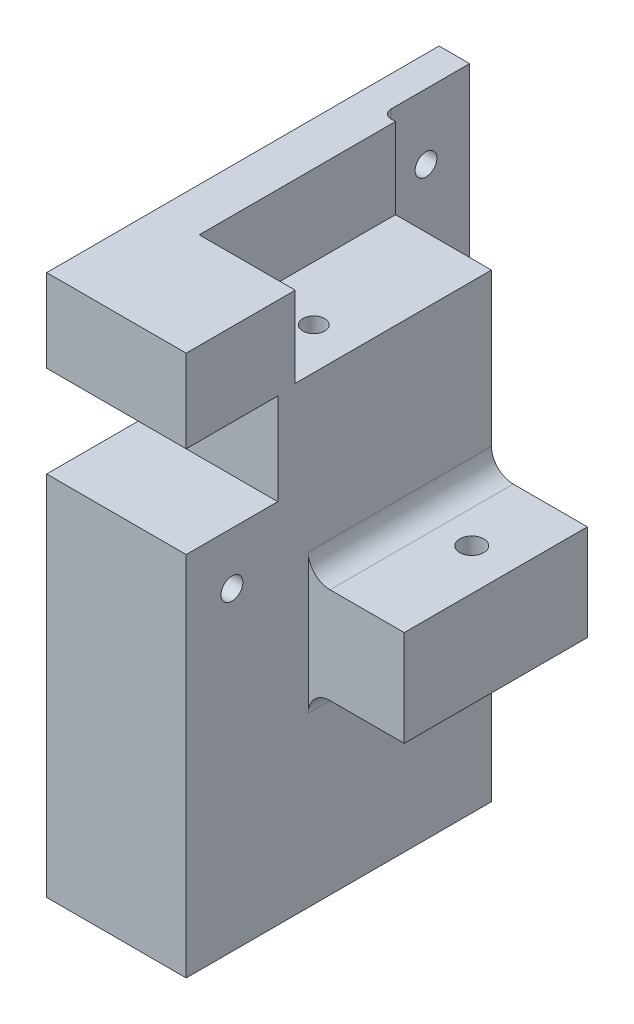
ISO-10303-21;
HEADER;
FILE_DESCRIPTION(('STEP AP214'),'2;1');
FILE_NAME('part.step','',(''),(''),'','','');
FILE_SCHEMA(('AUTOMOTIVE_DESIGN { 1 0 10303 214 1 1 1 1 }'));
ENDSEC;
DATA;
#1=APPLICATION_CONTEXT('core data for automotive mechanical design processes');
#2=APPLICATION_PROTOCOL_DEFINITION('international standard','automotive_design',2000,#1);
#3=PRODUCT_CONTEXT('',#1,'mechanical');
#4=PRODUCT('Part','Part','',(#3));
#5=PRODUCT_RELATED_PRODUCT_CATEGORY('part','',(#4));
#6=PRODUCT_DEFINITION_FORMATION('','',#4);
#7=PRODUCT_DEFINITION_CONTEXT('part definition',#1,'design');
#8=PRODUCT_DEFINITION('design','',#6,#7);
#9=PRODUCT_DEFINITION_SHAPE('','',#8);
#10=(LENGTH_UNIT() NAMED_UNIT(*) SI_UNIT(.MILLI.,.METRE.));
#11=(NAMED_UNIT(*) PLANE_ANGLE_UNIT() SI_UNIT($,.RADIAN.));
#12=(NAMED_UNIT(*) SI_UNIT($,.STERADIAN.) SOLID_ANGLE_UNIT());
#13=UNCERTAINTY_MEASURE_WITH_UNIT(LENGTH_MEASURE(1.E-05),#10,'distance_accuracy_value','');
#14=(GEOMETRIC_REPRESENTATION_CONTEXT(3) GLOBAL_UNCERTAINTY_ASSIGNED_CONTEXT((#13)) GLOBAL_UNIT_ASSIGNED_CONTEXT((#10,
#11,#12)) REPRESENTATION_CONTEXT('',''));
#15=CARTESIAN_POINT('',(0.,0.,0.));
#16=DIRECTION('',(0.,0.,1.));
#17=DIRECTION('',(1.,0.,0.));
#18=AXIS2_PLACEMENT_3D('',#15,#16,#17);
#19=CARTESIAN_POINT('',(16.,40.,-35.));
#20=DIRECTION('',(-1.,0.,0.));
#21=DIRECTION('',(0.,0.,1.));
#22=AXIS2_PLACEMENT_3D('',#19,#20,#21);
#23=PLANE('',#22);
#24=CARTESIAN_POINT('',(16.,-12.,24.5));
#25=DIRECTION('',(-1.,0.,0.));
#26=DIRECTION('',(0.,0.,1.));
#27=AXIS2_PLACEMENT_3D('',#24,#25,#26);
#28=CIRCLE('',#27,2.5);
#29=CARTESIAN_POINT('',(16.,-12.,27.));
#30=VERTEX_POINT('',#29);
#31=EDGE_CURVE('E209',#30,#30,#28,.T.);
#32=ORIENTED_EDGE('',*,*,#31,.T.);
#33=EDGE_LOOP('',(#32));
#34=FACE_BOUND('',#33,.T.);
#35=DIRECTION('',(0.,-1.,0.));
#36=VECTOR('',#35,1.);
#37=CARTESIAN_POINT('',(16.,-18.5000000000002,6.99999999999999));
#38=LINE('',#37,#36);
#39=CARTESIAN_POINT('',(16.,-13.5000000000002,6.99999999999999));
#40=VERTEX_POINT('',#39);
#41=CARTESIAN_POINT('',(16.,-45.5000000000002,7.));
#42=VERTEX_POINT('',#41);
#43=EDGE_CURVE('E227',#40,#42,#38,.T.);
#44=ORIENTED_EDGE('',*,*,#43,.F.);
#45=DIRECTION('',(0.,0.,1.));
#46=VECTOR('',#45,1.);
#47=CARTESIAN_POINT('',(16.,-13.5000000000002,-35.));
#48=LINE('',#47,#46);
#49=CARTESIAN_POINT('',(16.,-13.5000000000002,-35.));
#50=VERTEX_POINT('',#49);
#51=EDGE_CURVE('E345',#40,#50,#48,.F.);
#52=ORIENTED_EDGE('',*,*,#51,.T.);
#53=DIRECTION('',(0.,-1.,0.));
#54=VECTOR('',#53,1.);
#55=CARTESIAN_POINT('',(16.,40.,-35.));
#56=LINE('',#55,#54);
#57=CARTESIAN_POINT('',(16.,21.4999999999998,-35.));
#58=VERTEX_POINT('',#57);
#59=EDGE_CURVE('E330',#58,#50,#56,.T.);
#60=ORIENTED_EDGE('',*,*,#59,.F.);
#61=DIRECTION('',(0.,0.,-1.));
#62=VECTOR('',#61,1.);
#63=CARTESIAN_POINT('',(16.,21.4999999999998,-35.));
#64=LINE('',#63,#62);
#65=CARTESIAN_POINT('',(16.,21.4999999999998,9.99999999999999));
#66=VERTEX_POINT('',#65);
#67=EDGE_CURVE('E267',#66,#58,#64,.T.);
#68=ORIENTED_EDGE('',*,*,#67,.F.);
#69=DIRECTION('',(0.,1.,0.));
#70=VECTOR('',#69,1.);
#71=CARTESIAN_POINT('',(16.,-28.589919145473,9.99999999999999));
#72=LINE('',#71,#70);
#73=CARTESIAN_POINT('',(16.,40.,9.99999999999999));
#74=VERTEX_POINT('',#73);
#75=EDGE_CURVE('E258',#66,#74,#72,.T.);
#76=ORIENTED_EDGE('',*,*,#75,.T.);
#77=DIRECTION('',(0.,0.,-1.));
#78=VECTOR('',#77,1.);
#79=CARTESIAN_POINT('',(16.,40.,-35.));
#80=LINE('',#79,#78);
#81=CARTESIAN_POINT('',(16.,40.,35.));
#82=VERTEX_POINT('',#81);
#83=EDGE_CURVE('E310',#82,#74,#80,.T.);
#84=ORIENTED_EDGE('',*,*,#83,.F.);
#85=DIRECTION('',(0.,-1.,0.));
#86=VECTOR('',#85,1.);
#87=CARTESIAN_POINT('',(16.,40.,35.));
#88=LINE('',#87,#86);
#89=CARTESIAN_POINT('',(16.,21.,35.));
#90=VERTEX_POINT('',#89);
#91=EDGE_CURVE('E320',#82,#90,#88,.T.);
#92=ORIENTED_EDGE('',*,*,#91,.T.);
#93=DIRECTION('',(0.,0.,1.));
#94=VECTOR('',#93,1.);
#95=CARTESIAN_POINT('',(16.,21.,35.));
#96=LINE('',#95,#94);
#97=CARTESIAN_POINT('',(16.,21.,14.));
#98=VERTEX_POINT('',#97);
#99=EDGE_CURVE('E279',#98,#90,#96,.T.);
#100=ORIENTED_EDGE('',*,*,#99,.F.);
#101=DIRECTION('',(0.,1.,0.));
#102=VECTOR('',#101,1.);
#103=CARTESIAN_POINT('',(16.,21.,14.));
#104=LINE('',#103,#102);
#105=CARTESIAN_POINT('',(16.,0.,14.));
#106=VERTEX_POINT('',#105);
#107=EDGE_CURVE('E276',#106,#98,#104,.T.);
#108=ORIENTED_EDGE('',*,*,#107,.F.);
#109=DIRECTION('',(0.,0.,-1.));
#110=VECTOR('',#109,1.);
#111=CARTESIAN_POINT('',(16.,0.,35.));
#112=LINE('',#111,#110);
#113=CARTESIAN_POINT('',(16.,0.,35.));
#114=VERTEX_POINT('',#113);
#115=EDGE_CURVE('E273',#114,#106,#112,.T.);
#116=ORIENTED_EDGE('',*,*,#115,.F.);
#117=CARTESIAN_POINT('',(16.,-84.1,35.));
#118=VERTEX_POINT('',#117);
#119=EDGE_CURVE('E319',#114,#118,#88,.T.);
#120=ORIENTED_EDGE('',*,*,#119,.T.);
#121=DIRECTION('',(0.,0.,-1.));
#122=VECTOR('',#121,1.);
#123=CARTESIAN_POINT('',(16.,-84.1,-35.));
#124=LINE('',#123,#122);
#125=CARTESIAN_POINT('',(16.,-84.1,-35.));
#126=VERTEX_POINT('',#125);
#127=EDGE_CURVE('E293',#118,#126,#124,.T.);
#128=ORIENTED_EDGE('',*,*,#127,.T.);
#129=CARTESIAN_POINT('',(16.,-45.5000000000002,-35.));
#130=VERTEX_POINT('',#129);
#131=EDGE_CURVE('E329',#130,#126,#56,.T.);
#132=ORIENTED_EDGE('',*,*,#131,.F.);
#133=DIRECTION('',(0.,0.,-1.));
#134=VECTOR('',#133,1.);
#135=CARTESIAN_POINT('',(16.,-45.5000000000002,7.));
#136=LINE('',#135,#134);
#137=EDGE_CURVE('E342',#130,#42,#136,.F.);
#138=ORIENTED_EDGE('',*,*,#137,.T.);
#139=EDGE_LOOP('',(#44,#52,#60,#68,#76,#84,#92,#100,#108,#116,#120,#128,#132,#138));
#140=FACE_BOUND('',#139,.T.);
#141=ADVANCED_FACE('F35',(#34,#140),#23,.F.);
#142=CARTESIAN_POINT('',(-16.,40.,35.));
#143=DIRECTION('',(0.,0.,-1.));
#144=DIRECTION('',(-1.,0.,0.));
#145=AXIS2_PLACEMENT_3D('',#142,#143,#144);
#146=PLANE('',#145);
#147=DIRECTION('',(0.,-1.,0.));
#148=VECTOR('',#147,1.);
#149=CARTESIAN_POINT('',(-16.,40.,35.));
#150=LINE('',#149,#148);
#151=CARTESIAN_POINT('',(-16.,40.,35.));
#152=VERTEX_POINT('',#151);
#153=CARTESIAN_POINT('',(-16.,21.,35.));
#154=VERTEX_POINT('',#153);
#155=EDGE_CURVE('E324',#152,#154,#150,.T.);
#156=ORIENTED_EDGE('',*,*,#155,.T.);
#157=DIRECTION('',(1.,0.,0.));
#158=VECTOR('',#157,1.);
#159=CARTESIAN_POINT('',(-16.,21.,35.));
#160=LINE('',#159,#158);
#161=EDGE_CURVE('E290',#154,#90,#160,.T.);
#162=ORIENTED_EDGE('',*,*,#161,.T.);
#163=ORIENTED_EDGE('',*,*,#91,.F.);
#164=DIRECTION('',(1.,0.,0.));
#165=VECTOR('',#164,1.);
#166=CARTESIAN_POINT('',(-16.,40.,35.));
#167=LINE('',#166,#165);
#168=EDGE_CURVE('E317',#152,#82,#167,.T.);
#169=ORIENTED_EDGE('',*,*,#168,.F.);
#170=EDGE_LOOP('',(#156,#162,#163,#169));
#171=FACE_BOUND('',#170,.T.);
#172=ADVANCED_FACE('F390',(#171),#146,.F.);
#173=CARTESIAN_POINT('',(-16.,40.,-35.));
#174=DIRECTION('',(0.,0.,1.));
#175=DIRECTION('',(1.,0.,0.));
#176=AXIS2_PLACEMENT_3D('',#173,#174,#175);
#177=PLANE('',#176);
#178=DIRECTION('',(0.,-1.,0.));
#179=VECTOR('',#178,1.);
#180=CARTESIAN_POINT('',(-16.,40.,-35.));
#181=LINE('',#180,#179);
#182=CARTESIAN_POINT('',(-16.,-30.,-35.));
#183=VERTEX_POINT('',#182);
#184=CARTESIAN_POINT('',(-16.,-84.1,-35.));
#185=VERTEX_POINT('',#184);
#186=EDGE_CURVE('E327',#183,#185,#181,.T.);
#187=ORIENTED_EDGE('',*,*,#186,.F.);
#188=DIRECTION('',(1.,0.,0.));
#189=VECTOR('',#188,1.);
#190=CARTESIAN_POINT('',(-16.,-30.,-35.));
#191=LINE('',#190,#189);
#192=CARTESIAN_POINT('',(-6.99999999999999,-30.,-35.));
#193=VERTEX_POINT('',#192);
#194=EDGE_CURVE('E350',#183,#193,#191,.T.);
#195=ORIENTED_EDGE('',*,*,#194,.T.);
#196=DIRECTION('',(0.,1.,0.));
#197=VECTOR('',#196,1.);
#198=CARTESIAN_POINT('',(-7.,40.,-35.));
#199=LINE('',#198,#197);
#200=CARTESIAN_POINT('',(-7.,40.,-35.));
#201=VERTEX_POINT('',#200);
#202=EDGE_CURVE('E333',#193,#201,#199,.T.);
#203=ORIENTED_EDGE('',*,*,#202,.T.);
#204=DIRECTION('',(-1.,0.,0.));
#205=VECTOR('',#204,1.);
#206=CARTESIAN_POINT('',(-16.,40.,-35.));
#207=LINE('',#206,#205);
#208=CARTESIAN_POINT('',(-5.99999999999999,40.,-35.));
#209=VERTEX_POINT('',#208);
#210=EDGE_CURVE('E313',#209,#201,#207,.T.);
#211=ORIENTED_EDGE('',*,*,#210,.F.);
#212=DIRECTION('',(0.,1.,0.));
#213=VECTOR('',#212,1.);
#214=CARTESIAN_POINT('',(-5.99999999999999,-28.589919145473,-35.));
#215=LINE('',#214,#213);
#216=CARTESIAN_POINT('',(-5.99999999999999,21.4999999999997,-35.));
#217=VERTEX_POINT('',#216);
#218=EDGE_CURVE('E263',#217,#209,#215,.T.);
#219=ORIENTED_EDGE('',*,*,#218,.F.);
#220=DIRECTION('',(-1.,0.,0.));
#221=VECTOR('',#220,1.);
#222=CARTESIAN_POINT('',(-6.00000000000017,21.4999999999997,-35.));
#223=LINE('',#222,#221);
#224=EDGE_CURVE('E264',#58,#217,#223,.T.);
#225=ORIENTED_EDGE('',*,*,#224,.F.);
#226=ORIENTED_EDGE('',*,*,#59,.T.);
#227=CARTESIAN_POINT('',(21.,-13.5000000000002,-35.));
#228=DIRECTION('',(0.,0.,1.));
#229=DIRECTION('',(1.,0.,0.));
#230=AXIS2_PLACEMENT_3D('',#227,#228,#229);
#231=CIRCLE('',#230,5.);
#232=CARTESIAN_POINT('',(21.,-18.5000000000002,-35.));
#233=VERTEX_POINT('',#232);
#234=EDGE_CURVE('E357',#50,#233,#231,.T.);
#235=ORIENTED_EDGE('',*,*,#234,.T.);
#236=DIRECTION('',(-1.,0.,0.));
#237=VECTOR('',#236,1.);
#238=CARTESIAN_POINT('',(38.,-18.5000000000002,-35.));
#239=LINE('',#238,#237);
#240=CARTESIAN_POINT('',(38.,-18.5000000000002,-35.));
#241=VERTEX_POINT('',#240);
#242=EDGE_CURVE('E241',#241,#233,#239,.T.);
#243=ORIENTED_EDGE('',*,*,#242,.F.);
#244=DIRECTION('',(0.,1.,0.));
#245=VECTOR('',#244,1.);
#246=CARTESIAN_POINT('',(38.,-40.5000000000002,-35.));
#247=LINE('',#246,#245);
#248=CARTESIAN_POINT('',(38.,-40.5000000000002,-35.));
#249=VERTEX_POINT('',#248);
#250=EDGE_CURVE('E233',#249,#241,#247,.T.);
#251=ORIENTED_EDGE('',*,*,#250,.F.);
#252=DIRECTION('',(-1.,0.,0.));
#253=VECTOR('',#252,1.);
#254=CARTESIAN_POINT('',(38.,-40.5000000000002,-35.));
#255=LINE('',#254,#253);
#256=CARTESIAN_POINT('',(21.,-40.5000000000002,-35.));
#257=VERTEX_POINT('',#256);
#258=EDGE_CURVE('E244',#249,#257,#255,.T.);
#259=ORIENTED_EDGE('',*,*,#258,.T.);
#260=CARTESIAN_POINT('',(21.,-45.5000000000002,-35.));
#261=DIRECTION('',(0.,0.,1.));
#262=DIRECTION('',(1.,0.,0.));
#263=AXIS2_PLACEMENT_3D('',#260,#261,#262);
#264=CIRCLE('',#263,5.);
#265=EDGE_CURVE('E359',#257,#130,#264,.T.);
#266=ORIENTED_EDGE('',*,*,#265,.T.);
#267=ORIENTED_EDGE('',*,*,#131,.T.);
#268=DIRECTION('',(-1.,0.,0.));
#269=VECTOR('',#268,1.);
#270=CARTESIAN_POINT('',(-16.,-84.1,-35.));
#271=LINE('',#270,#269);
#272=EDGE_CURVE('E301',#126,#185,#271,.T.);
#273=ORIENTED_EDGE('',*,*,#272,.T.);
#274=EDGE_LOOP('',(#187,#195,#203,#211,#219,#225,#226,#235,#243,#251,#259,#266,#267,#273));
#275=FACE_BOUND('',#274,.T.);
#276=ADVANCED_FACE('F395',(#275),#177,.F.);
#277=CARTESIAN_POINT('',(-16.,40.,-35.));
#278=DIRECTION('',(1.,0.,0.));
#279=DIRECTION('',(0.,0.,-1.));
#280=AXIS2_PLACEMENT_3D('',#277,#278,#279);
#281=PLANE('',#280);
#282=CARTESIAN_POINT('',(-16.,25.,-45.));
#283=DIRECTION('',(1.,0.,0.));
#284=DIRECTION('',(0.,1.,0.));
#285=AXIS2_PLACEMENT_3D('',#282,#283,#284);
#286=CIRCLE('',#285,2.5);
#287=CARTESIAN_POINT('',(-16.,27.5,-45.));
#288=VERTEX_POINT('',#287);
#289=EDGE_CURVE('E697',#288,#288,#286,.T.);
#290=ORIENTED_EDGE('',*,*,#289,.T.);
#291=EDGE_LOOP('',(#290));
#292=FACE_BOUND('',#291,.T.);
#293=CARTESIAN_POINT('',(-16.,-10.,-45.));
#294=DIRECTION('',(1.,0.,0.));
#295=DIRECTION('',(0.,1.,0.));
#296=AXIS2_PLACEMENT_3D('',#293,#294,#295);
#297=CIRCLE('',#296,2.5);
#298=CARTESIAN_POINT('',(-16.,-7.5,-45.));
#299=VERTEX_POINT('',#298);
#300=EDGE_CURVE('E705',#299,#299,#297,.T.);
#301=ORIENTED_EDGE('',*,*,#300,.T.);
#302=EDGE_LOOP('',(#301));
#303=FACE_BOUND('',#302,.T.);
#304=CARTESIAN_POINT('',(-16.,-12.,24.5));
#305=DIRECTION('',(-1.,0.,0.));
#306=DIRECTION('',(0.,0.,1.));
#307=AXIS2_PLACEMENT_3D('',#304,#305,#306);
#308=CIRCLE('',#307,2.5);
#309=CARTESIAN_POINT('',(-16.,-12.,27.));
#310=VERTEX_POINT('',#309);
#311=EDGE_CURVE('E212',#310,#310,#308,.T.);
#312=ORIENTED_EDGE('',*,*,#311,.F.);
#313=EDGE_LOOP('',(#312));
#314=FACE_BOUND('',#313,.T.);
#315=DIRECTION('',(0.,1.,0.));
#316=VECTOR('',#315,1.);
#317=CARTESIAN_POINT('',(-16.,21.,14.));
#318=LINE('',#317,#316);
#319=CARTESIAN_POINT('',(-16.,0.,14.));
#320=VERTEX_POINT('',#319);
#321=CARTESIAN_POINT('',(-16.,21.,14.));
#322=VERTEX_POINT('',#321);
#323=EDGE_CURVE('E284',#320,#322,#318,.T.);
#324=ORIENTED_EDGE('',*,*,#323,.T.);
#325=DIRECTION('',(0.,0.,1.));
#326=VECTOR('',#325,1.);
#327=CARTESIAN_POINT('',(-16.,21.,35.));
#328=LINE('',#327,#326);
#329=EDGE_CURVE('E286',#322,#154,#328,.T.);
#330=ORIENTED_EDGE('',*,*,#329,.T.);
#331=ORIENTED_EDGE('',*,*,#155,.F.);
#332=DIRECTION('',(0.,0.,1.));
#333=VECTOR('',#332,1.);
#334=CARTESIAN_POINT('',(-16.,40.,-35.));
#335=LINE('',#334,#333);
#336=CARTESIAN_POINT('',(-16.,40.,-55.));
#337=VERTEX_POINT('',#336);
#338=EDGE_CURVE('E208',#337,#152,#335,.T.);
#339=ORIENTED_EDGE('',*,*,#338,.F.);
#340=DIRECTION('',(0.,-1.,0.));
#341=VECTOR('',#340,1.);
#342=CARTESIAN_POINT('',(-16.,-25.,-55.));
#343=LINE('',#342,#341);
#344=CARTESIAN_POINT('',(-16.,-25.,-55.));
#345=VERTEX_POINT('',#344);
#346=EDGE_CURVE('E200',#337,#345,#343,.T.);
#347=ORIENTED_EDGE('',*,*,#346,.T.);
#348=DIRECTION('',(0.,0.,1.));
#349=VECTOR('',#348,1.);
#350=CARTESIAN_POINT('',(-16.,-25.,-55.));
#351=LINE('',#350,#349);
#352=CARTESIAN_POINT('',(-16.,-25.,-40.));
#353=VERTEX_POINT('',#352);
#354=EDGE_CURVE('E183',#345,#353,#351,.T.);
#355=ORIENTED_EDGE('',*,*,#354,.T.);
#356=CARTESIAN_POINT('',(-16.,-30.,-40.));
#357=DIRECTION('',(1.,0.,0.));
#358=DIRECTION('',(0.,0.,-1.));
#359=AXIS2_PLACEMENT_3D('',#356,#357,#358);
#360=CIRCLE('',#359,5.);
#361=EDGE_CURVE('E11',#353,#183,#360,.T.);
#362=ORIENTED_EDGE('',*,*,#361,.T.);
#363=ORIENTED_EDGE('',*,*,#186,.T.);
#364=DIRECTION('',(0.,0.,1.));
#365=VECTOR('',#364,1.);
#366=CARTESIAN_POINT('',(-16.,-84.1,-35.));
#367=LINE('',#366,#365);
#368=CARTESIAN_POINT('',(-16.,-84.1,35.));
#369=VERTEX_POINT('',#368);
#370=EDGE_CURVE('E304',#185,#369,#367,.T.);
#371=ORIENTED_EDGE('',*,*,#370,.T.);
#372=CARTESIAN_POINT('',(-16.,0.,35.));
#373=VERTEX_POINT('',#372);
#374=EDGE_CURVE('E323',#373,#369,#150,.T.);
#375=ORIENTED_EDGE('',*,*,#374,.F.);
#376=DIRECTION('',(0.,0.,-1.));
#377=VECTOR('',#376,1.);
#378=CARTESIAN_POINT('',(-16.,0.,35.));
#379=LINE('',#378,#377);
#380=EDGE_CURVE('E281',#373,#320,#379,.T.);
#381=ORIENTED_EDGE('',*,*,#380,.T.);
#382=EDGE_LOOP('',(#324,#330,#331,#339,#347,#355,#362,#363,#371,#375,#381));
#383=FACE_BOUND('',#382,.T.);
#384=ADVANCED_FACE('F206',(#292,#303,#314,#383),#281,.F.);
#385=ORIENTED_EDGE('',*,*,#119,.F.);
#386=DIRECTION('',(1.,0.,0.));
#387=VECTOR('',#386,1.);
#388=CARTESIAN_POINT('',(-16.,0.,35.));
#389=LINE('',#388,#387);
#390=EDGE_CURVE('E289',#373,#114,#389,.T.);
#391=ORIENTED_EDGE('',*,*,#390,.F.);
#392=ORIENTED_EDGE('',*,*,#374,.T.);
#393=DIRECTION('',(1.,0.,0.));
#394=VECTOR('',#393,1.);
#395=CARTESIAN_POINT('',(-16.,-84.1,35.));
#396=LINE('',#395,#394);
#397=EDGE_CURVE('E307',#369,#118,#396,.T.);
#398=ORIENTED_EDGE('',*,*,#397,.T.);
#399=EDGE_LOOP('',(#385,#391,#392,#398));
#400=FACE_BOUND('',#399,.T.);
#401=ADVANCED_FACE('F398',(#400),#146,.F.);
#402=CARTESIAN_POINT('',(0.,40.,0.));
#403=DIRECTION('',(0.,1.,0.));
#404=DIRECTION('',(0.,0.,1.));
#405=AXIS2_PLACEMENT_3D('',#402,#403,#404);
#406=PLANE('',#405);
#407=DIRECTION('',(1.,0.,0.));
#408=VECTOR('',#407,1.);
#409=CARTESIAN_POINT('',(-5.99999999999999,40.,9.99999999999999));
#410=LINE('',#409,#408);
#411=CARTESIAN_POINT('',(-5.99999999999999,40.,9.99999999999999));
#412=VERTEX_POINT('',#411);
#413=EDGE_CURVE('E251',#412,#74,#410,.T.);
#414=ORIENTED_EDGE('',*,*,#413,.F.);
#415=DIRECTION('',(0.,0.,1.));
#416=VECTOR('',#415,1.);
#417=CARTESIAN_POINT('',(-5.99999999999999,40.,-35.));
#418=LINE('',#417,#416);
#419=EDGE_CURVE('E250',#209,#412,#418,.T.);
#420=ORIENTED_EDGE('',*,*,#419,.F.);
#421=ORIENTED_EDGE('',*,*,#210,.T.);
#422=CARTESIAN_POINT('',(-7.,40.,-37.));
#423=DIRECTION('',(0.,1.,0.));
#424=DIRECTION('',(0.,0.,1.));
#425=AXIS2_PLACEMENT_3D('',#422,#423,#424);
#426=CIRCLE('',#425,2.);
#427=CARTESIAN_POINT('',(-9.,40.,-37.));
#428=VERTEX_POINT('',#427);
#429=EDGE_CURVE('E337',#201,#428,#426,.F.);
#430=ORIENTED_EDGE('',*,*,#429,.T.);
#431=DIRECTION('',(0.,0.,1.));
#432=VECTOR('',#431,1.);
#433=CARTESIAN_POINT('',(-9.,40.,-55.));
#434=LINE('',#433,#432);
#435=CARTESIAN_POINT('',(-9.,40.,-55.));
#436=VERTEX_POINT('',#435);
#437=EDGE_CURVE('E218',#436,#428,#434,.T.);
#438=ORIENTED_EDGE('',*,*,#437,.F.);
#439=DIRECTION('',(-1.,0.,0.));
#440=VECTOR('',#439,1.);
#441=CARTESIAN_POINT('',(-16.,40.,-55.));
#442=LINE('',#441,#440);
#443=EDGE_CURVE('E193',#436,#337,#442,.T.);
#444=ORIENTED_EDGE('',*,*,#443,.T.);
#445=ORIENTED_EDGE('',*,*,#338,.T.);
#446=ORIENTED_EDGE('',*,*,#168,.T.);
#447=ORIENTED_EDGE('',*,*,#83,.T.);
#448=EDGE_LOOP('',(#414,#420,#421,#430,#438,#444,#445,#446,#447));
#449=FACE_BOUND('',#448,.T.);
#450=ADVANCED_FACE('F465',(#449),#406,.T.);
#451=CARTESIAN_POINT('',(0.,-84.1,0.));
#452=DIRECTION('',(0.,1.,0.));
#453=DIRECTION('',(0.,0.,1.));
#454=AXIS2_PLACEMENT_3D('',#451,#452,#453);
#455=PLANE('',#454);
#456=ORIENTED_EDGE('',*,*,#127,.F.);
#457=ORIENTED_EDGE('',*,*,#397,.F.);
#458=ORIENTED_EDGE('',*,*,#370,.F.);
#459=ORIENTED_EDGE('',*,*,#272,.F.);
#460=EDGE_LOOP('',(#456,#457,#458,#459));
#461=FACE_BOUND('',#460,.T.);
#462=ADVANCED_FACE('F455',(#461),#455,.F.);
#463=CARTESIAN_POINT('',(-16.,21.,35.));
#464=DIRECTION('',(0.,1.,0.));
#465=DIRECTION('',(0.,0.,1.));
#466=AXIS2_PLACEMENT_3D('',#463,#464,#465);
#467=PLANE('',#466);
#468=ORIENTED_EDGE('',*,*,#161,.F.);
#469=ORIENTED_EDGE('',*,*,#329,.F.);
#470=DIRECTION('',(1.,0.,0.));
#471=VECTOR('',#470,1.);
#472=CARTESIAN_POINT('',(-16.,21.,14.));
#473=LINE('',#472,#471);
#474=EDGE_CURVE('E294',#322,#98,#473,.T.);
#475=ORIENTED_EDGE('',*,*,#474,.T.);
#476=ORIENTED_EDGE('',*,*,#99,.T.);
#477=EDGE_LOOP('',(#468,#469,#475,#476));
#478=FACE_BOUND('',#477,.T.);
#479=ADVANCED_FACE('F451',(#478),#467,.F.);
#480=CARTESIAN_POINT('',(-16.,21.,14.));
#481=DIRECTION('',(0.,0.,-1.));
#482=DIRECTION('',(0.,1.,0.));
#483=AXIS2_PLACEMENT_3D('',#480,#481,#482);
#484=PLANE('',#483);
#485=ORIENTED_EDGE('',*,*,#474,.F.);
#486=ORIENTED_EDGE('',*,*,#323,.F.);
#487=DIRECTION('',(1.,0.,0.));
#488=VECTOR('',#487,1.);
#489=CARTESIAN_POINT('',(-16.,0.,14.));
#490=LINE('',#489,#488);
#491=EDGE_CURVE('E296',#320,#106,#490,.T.);
#492=ORIENTED_EDGE('',*,*,#491,.T.);
#493=ORIENTED_EDGE('',*,*,#107,.T.);
#494=EDGE_LOOP('',(#485,#486,#492,#493));
#495=FACE_BOUND('',#494,.T.);
#496=ADVANCED_FACE('F454',(#495),#484,.F.);
#497=CARTESIAN_POINT('',(-16.,0.,35.));
#498=DIRECTION('',(0.,-1.,0.));
#499=DIRECTION('',(0.,0.,-1.));
#500=AXIS2_PLACEMENT_3D('',#497,#498,#499);
#501=PLANE('',#500);
#502=ORIENTED_EDGE('',*,*,#491,.F.);
#503=ORIENTED_EDGE('',*,*,#380,.F.);
#504=ORIENTED_EDGE('',*,*,#390,.T.);
#505=ORIENTED_EDGE('',*,*,#115,.T.);
#506=EDGE_LOOP('',(#502,#503,#504,#505));
#507=FACE_BOUND('',#506,.T.);
#508=ADVANCED_FACE('F449',(#507),#501,.F.);
#509=CARTESIAN_POINT('',(32.276000000002,21.4999999999999,-10.2240000000004));
#510=DIRECTION('',(0.,-1.,0.));
#511=DIRECTION('',(1.,0.,0.));
#512=AXIS2_PLACEMENT_3D('',#509,#510,#511);
#513=PLANE('',#512);
#514=CARTESIAN_POINT('',(6.5,21.4999999999998,-3.75));
#515=DIRECTION('',(0.,1.,0.));
#516=DIRECTION('',(1.,0.,0.));
#517=AXIS2_PLACEMENT_3D('',#514,#515,#516);
#518=CIRCLE('',#517,2.5);
#519=CARTESIAN_POINT('',(9.,21.4999999999998,-3.75));
#520=VERTEX_POINT('',#519);
#521=EDGE_CURVE('E711',#520,#520,#518,.T.);
#522=ORIENTED_EDGE('',*,*,#521,.F.);
#523=EDGE_LOOP('',(#522));
#524=FACE_BOUND('',#523,.T.);
#525=DIRECTION('',(0.,0.,1.));
#526=VECTOR('',#525,1.);
#527=CARTESIAN_POINT('',(-5.99999999999999,21.4999999999997,-35.));
#528=LINE('',#527,#526);
#529=CARTESIAN_POINT('',(-5.99999999999999,21.4999999999997,9.99999999999999));
#530=VERTEX_POINT('',#529);
#531=EDGE_CURVE('E259',#217,#530,#528,.T.);
#532=ORIENTED_EDGE('',*,*,#531,.T.);
#533=DIRECTION('',(1.,0.,0.));
#534=VECTOR('',#533,1.);
#535=CARTESIAN_POINT('',(-6.00000000000016,21.4999999999997,9.99999999999999));
#536=LINE('',#535,#534);
#537=EDGE_CURVE('E253',#530,#66,#536,.T.);
#538=ORIENTED_EDGE('',*,*,#537,.T.);
#539=ORIENTED_EDGE('',*,*,#67,.T.);
#540=ORIENTED_EDGE('',*,*,#224,.T.);
#541=EDGE_LOOP('',(#532,#538,#539,#540));
#542=FACE_BOUND('',#541,.T.);
#543=ADVANCED_FACE('F445',(#524,#542),#513,.F.);
#544=CARTESIAN_POINT('',(-5.99999999999999,-28.589919145473,9.99999999999999));
#545=DIRECTION('',(0.,0.,1.));
#546=DIRECTION('',(1.,0.,0.));
#547=AXIS2_PLACEMENT_3D('',#544,#545,#546);
#548=PLANE('',#547);
#549=DIRECTION('',(0.,1.,0.));
#550=VECTOR('',#549,1.);
#551=CARTESIAN_POINT('',(-5.99999999999999,-28.589919145473,9.99999999999999));
#552=LINE('',#551,#550);
#553=EDGE_CURVE('E262',#530,#412,#552,.T.);
#554=ORIENTED_EDGE('',*,*,#553,.T.);
#555=ORIENTED_EDGE('',*,*,#413,.T.);
#556=ORIENTED_EDGE('',*,*,#75,.F.);
#557=ORIENTED_EDGE('',*,*,#537,.F.);
#558=EDGE_LOOP('',(#554,#555,#556,#557));
#559=FACE_BOUND('',#558,.T.);
#560=ADVANCED_FACE('F441',(#559),#548,.F.);
#561=CARTESIAN_POINT('',(-5.99999999999999,-28.589919145473,-35.));
#562=DIRECTION('',(-1.,0.,0.));
#563=DIRECTION('',(0.,0.,1.));
#564=AXIS2_PLACEMENT_3D('',#561,#562,#563);
#565=PLANE('',#564);
#566=ORIENTED_EDGE('',*,*,#218,.T.);
#567=ORIENTED_EDGE('',*,*,#419,.T.);
#568=ORIENTED_EDGE('',*,*,#553,.F.);
#569=ORIENTED_EDGE('',*,*,#531,.F.);
#570=EDGE_LOOP('',(#566,#567,#568,#569));
#571=FACE_BOUND('',#570,.T.);
#572=ADVANCED_FACE('F435',(#571),#565,.F.);
#573=CARTESIAN_POINT('',(38.,-18.5000000000002,6.99999999999999));
#574=DIRECTION('',(0.,0.,-1.));
#575=DIRECTION('',(0.,1.,0.));
#576=AXIS2_PLACEMENT_3D('',#573,#574,#575);
#577=PLANE('',#576);
#578=ORIENTED_EDGE('',*,*,#43,.T.);
#579=CARTESIAN_POINT('',(21.,-45.5000000000002,7.));
#580=DIRECTION('',(0.,0.,-1.));
#581=DIRECTION('',(0.,1.,0.));
#582=AXIS2_PLACEMENT_3D('',#579,#580,#581);
#583=CIRCLE('',#582,5.);
#584=CARTESIAN_POINT('',(21.,-40.5000000000002,7.));
#585=VERTEX_POINT('',#584);
#586=EDGE_CURVE('E361',#42,#585,#583,.T.);
#587=ORIENTED_EDGE('',*,*,#586,.T.);
#588=DIRECTION('',(-1.,0.,0.));
#589=VECTOR('',#588,1.);
#590=CARTESIAN_POINT('',(38.,-40.5000000000002,6.99999999999999));
#591=LINE('',#590,#589);
#592=CARTESIAN_POINT('',(38.,-40.5000000000002,6.99999999999999));
#593=VERTEX_POINT('',#592);
#594=EDGE_CURVE('E247',#593,#585,#591,.T.);
#595=ORIENTED_EDGE('',*,*,#594,.F.);
#596=DIRECTION('',(0.,-1.,0.));
#597=VECTOR('',#596,1.);
#598=CARTESIAN_POINT('',(38.,-18.5000000000002,6.99999999999999));
#599=LINE('',#598,#597);
#600=CARTESIAN_POINT('',(38.,-18.5000000000002,6.99999999999999));
#601=VERTEX_POINT('',#600);
#602=EDGE_CURVE('E228',#601,#593,#599,.T.);
#603=ORIENTED_EDGE('',*,*,#602,.F.);
#604=DIRECTION('',(-1.,0.,0.));
#605=VECTOR('',#604,1.);
#606=CARTESIAN_POINT('',(38.,-18.5000000000002,6.99999999999999));
#607=LINE('',#606,#605);
#608=CARTESIAN_POINT('',(21.,-18.5000000000002,6.99999999999999));
#609=VERTEX_POINT('',#608);
#610=EDGE_CURVE('E237',#601,#609,#607,.T.);
#611=ORIENTED_EDGE('',*,*,#610,.T.);
#612=CARTESIAN_POINT('',(21.,-13.5000000000002,6.99999999999999));
#613=DIRECTION('',(0.,0.,-1.));
#614=DIRECTION('',(0.,1.,0.));
#615=AXIS2_PLACEMENT_3D('',#612,#613,#614);
#616=CIRCLE('',#615,5.);
#617=EDGE_CURVE('E354',#609,#40,#616,.T.);
#618=ORIENTED_EDGE('',*,*,#617,.T.);
#619=EDGE_LOOP('',(#578,#587,#595,#603,#611,#618));
#620=FACE_BOUND('',#619,.T.);
#621=ADVANCED_FACE('F406',(#620),#577,.F.);
#622=CARTESIAN_POINT('',(38.,-40.5000000000002,6.99999999999999));
#623=DIRECTION('',(0.,1.,0.));
#624=DIRECTION('',(0.,0.,1.));
#625=AXIS2_PLACEMENT_3D('',#622,#623,#624);
#626=PLANE('',#625);
#627=CARTESIAN_POINT('',(28.5,-40.5000000000002,-18.));
#628=DIRECTION('',(0.,1.,0.));
#629=DIRECTION('',(0.,0.,1.));
#630=AXIS2_PLACEMENT_3D('',#627,#628,#629);
#631=CIRCLE('',#630,2.74999999999999);
#632=CARTESIAN_POINT('',(28.5,-40.5000000000002,-15.25));
#633=VERTEX_POINT('',#632);
#634=EDGE_CURVE('E224',#633,#633,#631,.T.);
#635=ORIENTED_EDGE('',*,*,#634,.T.);
#636=EDGE_LOOP('',(#635));
#637=FACE_BOUND('',#636,.T.);
#638=ORIENTED_EDGE('',*,*,#594,.T.);
#639=DIRECTION('',(0.,0.,-1.));
#640=VECTOR('',#639,1.);
#641=CARTESIAN_POINT('',(21.,-40.5000000000002,-35.));
#642=LINE('',#641,#640);
#643=EDGE_CURVE('E347',#585,#257,#642,.T.);
#644=ORIENTED_EDGE('',*,*,#643,.T.);
#645=ORIENTED_EDGE('',*,*,#258,.F.);
#646=DIRECTION('',(0.,0.,-1.));
#647=VECTOR('',#646,1.);
#648=CARTESIAN_POINT('',(38.,-40.5000000000002,6.99999999999999));
#649=LINE('',#648,#647);
#650=EDGE_CURVE('E231',#593,#249,#649,.T.);
#651=ORIENTED_EDGE('',*,*,#650,.F.);
#652=EDGE_LOOP('',(#638,#644,#645,#651));
#653=FACE_BOUND('',#652,.T.);
#654=ADVANCED_FACE('F424',(#637,#653),#626,.F.);
#655=CARTESIAN_POINT('',(38.,-18.5000000000002,-35.));
#656=DIRECTION('',(0.,-1.,0.));
#657=DIRECTION('',(0.,0.,-1.));
#658=AXIS2_PLACEMENT_3D('',#655,#656,#657);
#659=PLANE('',#658);
#660=CARTESIAN_POINT('',(28.5,-18.5000000000002,-18.));
#661=DIRECTION('',(0.,1.,0.));
#662=DIRECTION('',(0.,0.,-1.));
#663=AXIS2_PLACEMENT_3D('',#660,#661,#662);
#664=CIRCLE('',#663,2.74999999999999);
#665=CARTESIAN_POINT('',(28.5,-18.5000000000002,-20.75));
#666=VERTEX_POINT('',#665);
#667=EDGE_CURVE('E220',#666,#666,#664,.T.);
#668=ORIENTED_EDGE('',*,*,#667,.F.);
#669=EDGE_LOOP('',(#668));
#670=FACE_BOUND('',#669,.T.);
#671=ORIENTED_EDGE('',*,*,#242,.T.);
#672=DIRECTION('',(0.,0.,1.));
#673=VECTOR('',#672,1.);
#674=CARTESIAN_POINT('',(21.,-18.5000000000002,6.99999999999999));
#675=LINE('',#674,#673);
#676=EDGE_CURVE('E339',#233,#609,#675,.T.);
#677=ORIENTED_EDGE('',*,*,#676,.T.);
#678=ORIENTED_EDGE('',*,*,#610,.F.);
#679=DIRECTION('',(0.,0.,1.));
#680=VECTOR('',#679,1.);
#681=CARTESIAN_POINT('',(38.,-18.5000000000002,-35.));
#682=LINE('',#681,#680);
#683=EDGE_CURVE('E235',#241,#601,#682,.T.);
#684=ORIENTED_EDGE('',*,*,#683,.F.);
#685=EDGE_LOOP('',(#671,#677,#678,#684));
#686=FACE_BOUND('',#685,.T.);
#687=ADVANCED_FACE('F418',(#670,#686),#659,.F.);
#688=CARTESIAN_POINT('',(38.,0.,0.));
#689=DIRECTION('',(1.,0.,0.));
#690=DIRECTION('',(0.,0.,-1.));
#691=AXIS2_PLACEMENT_3D('',#688,#689,#690);
#692=PLANE('',#691);
#693=ORIENTED_EDGE('',*,*,#602,.T.);
#694=ORIENTED_EDGE('',*,*,#650,.T.);
#695=ORIENTED_EDGE('',*,*,#250,.T.);
#696=ORIENTED_EDGE('',*,*,#683,.T.);
#697=EDGE_LOOP('',(#693,#694,#695,#696));
#698=FACE_BOUND('',#697,.T.);
#699=ADVANCED_FACE('F420',(#698),#692,.T.);
#700=CARTESIAN_POINT('',(28.5,-84.1,-18.));
#701=DIRECTION('',(0.,1.,0.));
#702=DIRECTION('',(0.,0.,1.));
#703=AXIS2_PLACEMENT_3D('',#700,#701,#702);
#704=CYLINDRICAL_SURFACE('',#703,2.74999999999999);
#705=ORIENTED_EDGE('',*,*,#667,.T.);
#706=EDGE_LOOP('',(#705));
#707=FACE_BOUND('',#706,.T.);
#708=ORIENTED_EDGE('',*,*,#634,.F.);
#709=EDGE_LOOP('',(#708));
#710=FACE_BOUND('',#709,.T.);
#711=ADVANCED_FACE('F549',(#707,#710),#704,.F.);
#712=CARTESIAN_POINT('',(-9.,40.,-55.));
#713=DIRECTION('',(1.,0.,0.));
#714=DIRECTION('',(0.,1.,0.));
#715=AXIS2_PLACEMENT_3D('',#712,#713,#714);
#716=PLANE('',#715);
#717=CARTESIAN_POINT('',(-9.,25.,-45.));
#718=DIRECTION('',(1.,0.,0.));
#719=DIRECTION('',(0.,1.,0.));
#720=AXIS2_PLACEMENT_3D('',#717,#718,#719);
#721=CIRCLE('',#720,2.5);
#722=CARTESIAN_POINT('',(-9.,27.5,-45.));
#723=VERTEX_POINT('',#722);
#724=EDGE_CURVE('E699',#723,#723,#721,.T.);
#725=ORIENTED_EDGE('',*,*,#724,.F.);
#726=EDGE_LOOP('',(#725));
#727=FACE_BOUND('',#726,.T.);
#728=CARTESIAN_POINT('',(-8.99999999999999,-10.,-45.));
#729=DIRECTION('',(1.,0.,0.));
#730=DIRECTION('',(0.,1.,0.));
#731=AXIS2_PLACEMENT_3D('',#728,#729,#730);
#732=CIRCLE('',#731,2.5);
#733=CARTESIAN_POINT('',(-8.99999999999999,-7.5,-45.));
#734=VERTEX_POINT('',#733);
#735=EDGE_CURVE('E702',#734,#734,#732,.T.);
#736=ORIENTED_EDGE('',*,*,#735,.F.);
#737=EDGE_LOOP('',(#736));
#738=FACE_BOUND('',#737,.T.);
#739=ORIENTED_EDGE('',*,*,#437,.T.);
#740=DIRECTION('',(0.,1.,0.));
#741=VECTOR('',#740,1.);
#742=CARTESIAN_POINT('',(-9.,40.,-37.));
#743=LINE('',#742,#741);
#744=CARTESIAN_POINT('',(-8.99999999999999,-25.9999999999993,-37.));
#745=VERTEX_POINT('',#744);
#746=EDGE_CURVE('E51',#428,#745,#743,.F.);
#747=ORIENTED_EDGE('',*,*,#746,.T.);
#748=CARTESIAN_POINT('',(-8.99999999999999,-30.,-40.));
#749=DIRECTION('',(1.,0.,0.));
#750=DIRECTION('',(0.,1.,0.));
#751=AXIS2_PLACEMENT_3D('',#748,#749,#750);
#752=CIRCLE('',#751,5.);
#753=CARTESIAN_POINT('',(-8.99999999999999,-25.,-40.));
#754=VERTEX_POINT('',#753);
#755=EDGE_CURVE('E44',#745,#754,#752,.F.);
#756=ORIENTED_EDGE('',*,*,#755,.T.);
#757=DIRECTION('',(0.,0.,1.));
#758=VECTOR('',#757,1.);
#759=CARTESIAN_POINT('',(-8.99999999999999,-25.,-55.));
#760=LINE('',#759,#758);
#761=CARTESIAN_POINT('',(-8.99999999999999,-25.,-55.));
#762=VERTEX_POINT('',#761);
#763=EDGE_CURVE('E192',#762,#754,#760,.T.);
#764=ORIENTED_EDGE('',*,*,#763,.F.);
#765=DIRECTION('',(0.,1.,0.));
#766=VECTOR('',#765,1.);
#767=CARTESIAN_POINT('',(-9.,40.,-55.));
#768=LINE('',#767,#766);
#769=EDGE_CURVE('E203',#762,#436,#768,.T.);
#770=ORIENTED_EDGE('',*,*,#769,.T.);
#771=EDGE_LOOP('',(#739,#747,#756,#764,#770));
#772=FACE_BOUND('',#771,.T.);
#773=ADVANCED_FACE('F544',(#727,#738,#772),#716,.T.);
#774=CARTESIAN_POINT('',(-8.99999999999999,-25.,-55.));
#775=DIRECTION('',(0.,-1.,0.));
#776=DIRECTION('',(0.,0.,-1.));
#777=AXIS2_PLACEMENT_3D('',#774,#775,#776);
#778=PLANE('',#777);
#779=ORIENTED_EDGE('',*,*,#763,.T.);
#780=DIRECTION('',(1.,0.,0.));
#781=VECTOR('',#780,1.);
#782=CARTESIAN_POINT('',(-8.99999999999999,-25.,-40.));
#783=LINE('',#782,#781);
#784=EDGE_CURVE('E188',#754,#353,#783,.F.);
#785=ORIENTED_EDGE('',*,*,#784,.T.);
#786=ORIENTED_EDGE('',*,*,#354,.F.);
#787=DIRECTION('',(1.,0.,0.));
#788=VECTOR('',#787,1.);
#789=CARTESIAN_POINT('',(-8.99999999999999,-25.,-55.));
#790=LINE('',#789,#788);
#791=EDGE_CURVE('E186',#345,#762,#790,.T.);
#792=ORIENTED_EDGE('',*,*,#791,.T.);
#793=EDGE_LOOP('',(#779,#785,#786,#792));
#794=FACE_BOUND('',#793,.T.);
#795=ADVANCED_FACE('F185',(#794),#778,.T.);
#796=CARTESIAN_POINT('',(0.,0.,-55.));
#797=DIRECTION('',(0.,0.,-1.));
#798=DIRECTION('',(-1.,0.,0.));
#799=AXIS2_PLACEMENT_3D('',#796,#797,#798);
#800=PLANE('',#799);
#801=ORIENTED_EDGE('',*,*,#346,.F.);
#802=ORIENTED_EDGE('',*,*,#443,.F.);
#803=ORIENTED_EDGE('',*,*,#769,.F.);
#804=ORIENTED_EDGE('',*,*,#791,.F.);
#805=EDGE_LOOP('',(#801,#802,#803,#804));
#806=FACE_BOUND('',#805,.T.);
#807=ADVANCED_FACE('F198',(#806),#800,.T.);
#808=CARTESIAN_POINT('',(38.,-12.,24.5));
#809=DIRECTION('',(-1.,0.,0.));
#810=DIRECTION('',(0.,0.,1.));
#811=AXIS2_PLACEMENT_3D('',#808,#809,#810);
#812=CYLINDRICAL_SURFACE('',#811,2.5);
#813=ORIENTED_EDGE('',*,*,#311,.T.);
#814=EDGE_LOOP('',(#813));
#815=FACE_BOUND('',#814,.T.);
#816=ORIENTED_EDGE('',*,*,#31,.F.);
#817=EDGE_LOOP('',(#816));
#818=FACE_BOUND('',#817,.T.);
#819=ADVANCED_FACE('F613',(#815,#818),#812,.F.);
#820=CARTESIAN_POINT('',(-16.,-10.,-45.));
#821=DIRECTION('',(1.,0.,0.));
#822=DIRECTION('',(0.,1.,0.));
#823=AXIS2_PLACEMENT_3D('',#820,#821,#822);
#824=CYLINDRICAL_SURFACE('',#823,2.5);
#825=ORIENTED_EDGE('',*,*,#300,.F.);
#826=EDGE_LOOP('',(#825));
#827=FACE_BOUND('',#826,.T.);
#828=ORIENTED_EDGE('',*,*,#735,.T.);
#829=EDGE_LOOP('',(#828));
#830=FACE_BOUND('',#829,.T.);
#831=ADVANCED_FACE('F609',(#827,#830),#824,.F.);
#832=CARTESIAN_POINT('',(-16.,25.,-45.));
#833=DIRECTION('',(1.,0.,0.));
#834=DIRECTION('',(0.,1.,0.));
#835=AXIS2_PLACEMENT_3D('',#832,#833,#834);
#836=CYLINDRICAL_SURFACE('',#835,2.5);
#837=ORIENTED_EDGE('',*,*,#289,.F.);
#838=EDGE_LOOP('',(#837));
#839=FACE_BOUND('',#838,.T.);
#840=ORIENTED_EDGE('',*,*,#724,.T.);
#841=EDGE_LOOP('',(#840));
#842=FACE_BOUND('',#841,.T.);
#843=ADVANCED_FACE('F375',(#839,#842),#836,.F.);
#844=CARTESIAN_POINT('',(-7.,40.,-37.));
#845=DIRECTION('',(0.,1.,0.));
#846=DIRECTION('',(-1.,0.,0.));
#847=AXIS2_PLACEMENT_3D('',#844,#845,#846);
#848=CYLINDRICAL_SURFACE('',#847,2.);
#849=ORIENTED_EDGE('',*,*,#202,.F.);
#850=CARTESIAN_POINT('',(-8.99999999999999,-25.9999999999993,-37.));
#851=CARTESIAN_POINT('',(-8.99999324027343,-26.0512919389376,-36.9315858443195));
#852=CARTESIAN_POINT('',(-8.99649157203367,-26.1043221905042,-36.8645582185279));
#853=CARTESIAN_POINT('',(-8.98328909709587,-26.2133273103344,-36.7337630195361));
#854=CARTESIAN_POINT('',(-8.97359901559985,-26.269296930626,-36.6699900118237));
#855=CARTESIAN_POINT('',(-8.94892281271755,-26.3832847643707,-36.5465415072407));
#856=CARTESIAN_POINT('',(-8.93398790953147,-26.4412784471594,-36.4868328230554));
#857=CARTESIAN_POINT('',(-8.89947772515863,-26.5594732382405,-36.3710020267295));
#858=CARTESIAN_POINT('',(-8.87989972131976,-26.6196756241119,-36.3148820435626));
#859=CARTESIAN_POINT('',(-8.82755585094226,-26.7678914380316,-36.1833228460578));
#860=CARTESIAN_POINT('',(-8.79271857529375,-26.8568697936606,-36.109786181387));
#861=CARTESIAN_POINT('',(-8.71639941519381,-27.0378149034009,-35.9702943076292));
#862=CARTESIAN_POINT('',(-8.67491587974522,-27.1297823955068,-35.9043409893315));
#863=CARTESIAN_POINT('',(-8.54188878041805,-27.4103256805344,-35.7169733012536));
#864=CARTESIAN_POINT('',(-8.44210610731453,-27.6026488108272,-35.6068318494827));
#865=CARTESIAN_POINT('',(-8.2597364007566,-27.9360068086875,-35.4432848498548));
#866=CARTESIAN_POINT('',(-8.18064651072479,-28.0756041550299,-35.3827054455414));
#867=CARTESIAN_POINT('',(-8.01720624205831,-28.357086458045,-35.2752228503534));
#868=CARTESIAN_POINT('',(-7.93285356647591,-28.4989723932578,-35.2283256825109));
#869=CARTESIAN_POINT('',(-7.76068856633991,-28.783951273683,-35.1478758852137));
#870=CARTESIAN_POINT('',(-7.67288380491982,-28.9270410934593,-35.1142956946987));
#871=CARTESIAN_POINT('',(-7.49496780866756,-29.2141274184521,-35.0599857310583));
#872=CARTESIAN_POINT('',(-7.40485732147501,-29.3581236186331,-35.0392518461053));
#873=CARTESIAN_POINT('',(-7.2124452143146,-29.6640741180196,-35.0086525171965));
#874=CARTESIAN_POINT('',(-7.10998511037475,-29.8260977799931,-35.0004013073906));
#875=CARTESIAN_POINT('',(-7.00503949768048,-29.9920318535128,-35.0000047645928));
#876=CARTESIAN_POINT('',(-7.00251973242435,-29.9960159521503,-35.0000000029522));
#877=CARTESIAN_POINT('',(-6.99999999999999,-30.,-35.));
#878=B_SPLINE_CURVE_WITH_KNOTS('',3,(#850,#851,#852,#853,#854,#855,#856,#857,#858,#859,#860,
#861,#862,#863,#864,#865,#866,#867,#868,#869,#870,#871,#872,#873,#874,#875,#876,#877),
.UNSPECIFIED.,.F.,.F.,(4,2,2,2,2,2,2,2,2,2,2,2,2,4),(0.,0.256323586120961,0.512204136351131,
0.765652360303786,1.01924957198092,1.38041574025898,1.74167176531545,2.46784096790525,
2.98178501814777,3.49595497056337,4.00905516339212,4.52199103886897,5.09684964624155,
5.1109917890807),.UNSPECIFIED.);
#879=EDGE_CURVE('E363',#193,#745,#878,.F.);
#880=ORIENTED_EDGE('',*,*,#879,.T.);
#881=ORIENTED_EDGE('',*,*,#746,.F.);
#882=ORIENTED_EDGE('',*,*,#429,.F.);
#883=EDGE_LOOP('',(#849,#880,#881,#882));
#884=FACE_BOUND('',#883,.T.);
#885=ADVANCED_FACE('F369',(#884),#848,.F.);
#886=CARTESIAN_POINT('',(21.,-13.5000000000002,-35.));
#887=DIRECTION('',(0.,0.,-1.));
#888=DIRECTION('',(-1.,0.,0.));
#889=AXIS2_PLACEMENT_3D('',#886,#887,#888);
#890=CYLINDRICAL_SURFACE('',#889,5.);
#891=ORIENTED_EDGE('',*,*,#234,.F.);
#892=ORIENTED_EDGE('',*,*,#51,.F.);
#893=ORIENTED_EDGE('',*,*,#617,.F.);
#894=ORIENTED_EDGE('',*,*,#676,.F.);
#895=EDGE_LOOP('',(#891,#892,#893,#894));
#896=FACE_BOUND('',#895,.T.);
#897=ADVANCED_FACE('F374',(#896),#890,.F.);
#898=CARTESIAN_POINT('',(21.,-45.5000000000002,7.));
#899=DIRECTION('',(0.,0.,1.));
#900=DIRECTION('',(0.,-1.,0.));
#901=AXIS2_PLACEMENT_3D('',#898,#899,#900);
#902=CYLINDRICAL_SURFACE('',#901,5.);
#903=ORIENTED_EDGE('',*,*,#586,.F.);
#904=ORIENTED_EDGE('',*,*,#137,.F.);
#905=ORIENTED_EDGE('',*,*,#265,.F.);
#906=ORIENTED_EDGE('',*,*,#643,.F.);
#907=EDGE_LOOP('',(#903,#904,#905,#906));
#908=FACE_BOUND('',#907,.T.);
#909=ADVANCED_FACE('F379',(#908),#902,.F.);
#910=CARTESIAN_POINT('',(-16.,-30.,-40.));
#911=DIRECTION('',(1.,0.,0.));
#912=DIRECTION('',(0.,0.,-1.));
#913=AXIS2_PLACEMENT_3D('',#910,#911,#912);
#914=CYLINDRICAL_SURFACE('',#913,5.);
#915=ORIENTED_EDGE('',*,*,#361,.F.);
#916=ORIENTED_EDGE('',*,*,#784,.F.);
#917=ORIENTED_EDGE('',*,*,#755,.F.);
#918=ORIENTED_EDGE('',*,*,#879,.F.);
#919=ORIENTED_EDGE('',*,*,#194,.F.);
#920=EDGE_LOOP('',(#915,#916,#917,#918,#919));
#921=FACE_BOUND('',#920,.T.);
#922=ADVANCED_FACE('F37',(#921),#914,.F.);
#923=CARTESIAN_POINT('',(6.50000000000016,-25.9500000000002,-3.75));
#924=DIRECTION('',(0.,1.,0.));
#925=DIRECTION('',(-1.,0.,0.));
#926=AXIS2_PLACEMENT_3D('',#923,#924,#925);
#927=CYLINDRICAL_SURFACE('',#926,2.5);
#928=CARTESIAN_POINT('',(6.50000000000016,-25.9500000000002,-3.75));
#929=DIRECTION('',(0.,1.,0.));
#930=DIRECTION('',(1.,0.,0.));
#931=AXIS2_PLACEMENT_3D('',#928,#929,#930);
#932=CIRCLE('',#931,2.5);
#933=CARTESIAN_POINT('',(9.00000000000016,-25.9500000000002,-3.75));
#934=VERTEX_POINT('',#933);
#935=EDGE_CURVE('E706',#934,#934,#932,.T.);
#936=ORIENTED_EDGE('',*,*,#935,.F.);
#937=EDGE_LOOP('',(#936));
#938=FACE_BOUND('',#937,.T.);
#939=ORIENTED_EDGE('',*,*,#521,.T.);
#940=EDGE_LOOP('',(#939));
#941=FACE_BOUND('',#940,.T.);
#942=ADVANCED_FACE('F386',(#938,#941),#927,.F.);
#943=CARTESIAN_POINT('',(6.50000000000016,-25.9500000000002,-3.75));
#944=DIRECTION('',(0.,-1.,0.));
#945=DIRECTION('',(1.,0.,0.));
#946=AXIS2_PLACEMENT_3D('',#943,#944,#945);
#947=PLANE('',#946);
#948=ORIENTED_EDGE('',*,*,#935,.T.);
#949=EDGE_LOOP('',(#948));
#950=FACE_BOUND('',#949,.T.);
#951=ADVANCED_FACE('F592',(#950),#947,.F.);
#952=CLOSED_SHELL('',(#141,#172,#276,#384,#401,#450,#462,#479,#496,#508,#543,#560,#572,#621,
#654,#687,#699,#711,#773,#795,#807,#819,#831,#843,#885,#897,#909,#922,#942,#951));
#953=MANIFOLD_SOLID_BREP('B2',#952);
#954=ADVANCED_BREP_SHAPE_REPRESENTATION('',(#18,#953),#14);
#955=SHAPE_DEFINITION_REPRESENTATION(#9,#954);
ENDSEC;
END-ISO-10303-21;
